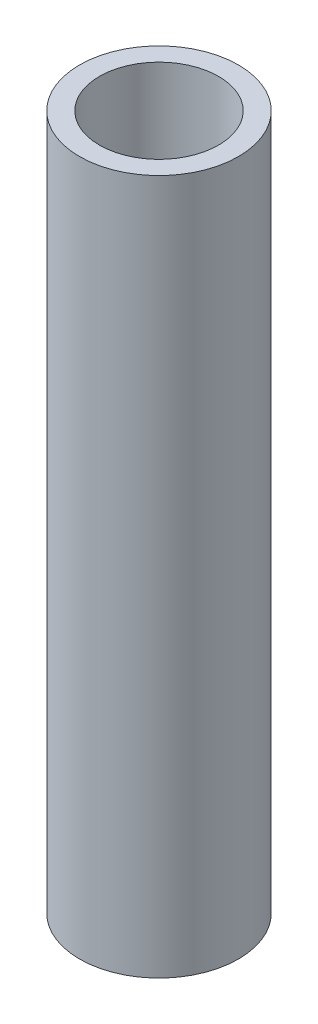
ISO-10303-21;
HEADER;
FILE_DESCRIPTION(('STEP AP214'),'2;1');
FILE_NAME('part.step','',(''),(''),'','','');
FILE_SCHEMA(('AUTOMOTIVE_DESIGN { 1 0 10303 214 1 1 1 1 }'));
ENDSEC;
DATA;
#1=APPLICATION_CONTEXT('core data for automotive mechanical design processes');
#2=APPLICATION_PROTOCOL_DEFINITION('international standard','automotive_design',2000,#1);
#3=PRODUCT_CONTEXT('',#1,'mechanical');
#4=PRODUCT('Part','Part','',(#3));
#5=PRODUCT_RELATED_PRODUCT_CATEGORY('part','',(#4));
#6=PRODUCT_DEFINITION_FORMATION('','',#4);
#7=PRODUCT_DEFINITION_CONTEXT('part definition',#1,'design');
#8=PRODUCT_DEFINITION('design','',#6,#7);
#9=PRODUCT_DEFINITION_SHAPE('','',#8);
#10=(LENGTH_UNIT() NAMED_UNIT(*) SI_UNIT(.MILLI.,.METRE.));
#11=(NAMED_UNIT(*) PLANE_ANGLE_UNIT() SI_UNIT($,.RADIAN.));
#12=(NAMED_UNIT(*) SI_UNIT($,.STERADIAN.) SOLID_ANGLE_UNIT());
#13=UNCERTAINTY_MEASURE_WITH_UNIT(LENGTH_MEASURE(1.E-05),#10,'distance_accuracy_value','');
#14=(GEOMETRIC_REPRESENTATION_CONTEXT(3) GLOBAL_UNCERTAINTY_ASSIGNED_CONTEXT((#13)) GLOBAL_UNIT_ASSIGNED_CONTEXT((#10,
#11,#12)) REPRESENTATION_CONTEXT('',''));
#15=CARTESIAN_POINT('',(0.,0.,0.));
#16=DIRECTION('',(0.,0.,1.));
#17=DIRECTION('',(1.,0.,0.));
#18=AXIS2_PLACEMENT_3D('',#15,#16,#17);
#19=CARTESIAN_POINT('',(0.,-70.,0.));
#20=DIRECTION('',(0.,1.,0.));
#21=DIRECTION('',(0.,0.,1.));
#22=AXIS2_PLACEMENT_3D('',#19,#20,#21);
#23=CYLINDRICAL_SURFACE('',#22,8.);
#24=CARTESIAN_POINT('',(0.,-70.,0.));
#25=DIRECTION('',(0.,1.,0.));
#26=DIRECTION('',(1.,0.,0.));
#27=AXIS2_PLACEMENT_3D('',#24,#25,#26);
#28=CIRCLE('',#27,8.);
#29=CARTESIAN_POINT('',(8.,-70.,0.));
#30=VERTEX_POINT('',#29);
#31=EDGE_CURVE('E11',#30,#30,#28,.T.);
#32=ORIENTED_EDGE('',*,*,#31,.T.);
#33=EDGE_LOOP('',(#32));
#34=FACE_BOUND('',#33,.T.);
#35=CARTESIAN_POINT('',(0.,0.,0.));
#36=DIRECTION('',(0.,1.,0.));
#37=DIRECTION('',(1.,0.,0.));
#38=AXIS2_PLACEMENT_3D('',#35,#36,#37);
#39=CIRCLE('',#38,8.);
#40=CARTESIAN_POINT('',(8.,0.,0.));
#41=VERTEX_POINT('',#40);
#42=EDGE_CURVE('E40',#41,#41,#39,.T.);
#43=ORIENTED_EDGE('',*,*,#42,.F.);
#44=EDGE_LOOP('',(#43));
#45=FACE_BOUND('',#44,.T.);
#46=ADVANCED_FACE('F37',(#34,#45),#23,.T.);
#47=CARTESIAN_POINT('',(0.,-70.,0.));
#48=DIRECTION('',(0.,1.,0.));
#49=DIRECTION('',(0.,0.,1.));
#50=AXIS2_PLACEMENT_3D('',#47,#48,#49);
#51=PLANE('',#50);
#52=CARTESIAN_POINT('',(0.,-70.,0.));
#53=DIRECTION('',(0.,1.,0.));
#54=DIRECTION('',(0.,0.,1.));
#55=AXIS2_PLACEMENT_3D('',#52,#53,#54);
#56=CIRCLE('',#55,6.);
#57=CARTESIAN_POINT('',(0.,-70.,6.));
#58=VERTEX_POINT('',#57);
#59=EDGE_CURVE('E47',#58,#58,#56,.T.);
#60=ORIENTED_EDGE('',*,*,#59,.T.);
#61=EDGE_LOOP('',(#60));
#62=FACE_BOUND('',#61,.T.);
#63=ORIENTED_EDGE('',*,*,#31,.F.);
#64=EDGE_LOOP('',(#63));
#65=FACE_BOUND('',#64,.T.);
#66=ADVANCED_FACE('F55',(#62,#65),#51,.F.);
#67=CARTESIAN_POINT('',(0.,0.,0.));
#68=DIRECTION('',(0.,1.,0.));
#69=DIRECTION('',(0.,0.,1.));
#70=AXIS2_PLACEMENT_3D('',#67,#68,#69);
#71=PLANE('',#70);
#72=CARTESIAN_POINT('',(0.,0.,0.));
#73=DIRECTION('',(0.,1.,0.));
#74=DIRECTION('',(0.,0.,1.));
#75=AXIS2_PLACEMENT_3D('',#72,#73,#74);
#76=CIRCLE('',#75,6.);
#77=CARTESIAN_POINT('',(0.,0.,6.));
#78=VERTEX_POINT('',#77);
#79=EDGE_CURVE('E49',#78,#78,#76,.T.);
#80=ORIENTED_EDGE('',*,*,#79,.F.);
#81=EDGE_LOOP('',(#80));
#82=FACE_BOUND('',#81,.T.);
#83=ORIENTED_EDGE('',*,*,#42,.T.);
#84=EDGE_LOOP('',(#83));
#85=FACE_BOUND('',#84,.T.);
#86=ADVANCED_FACE('F61',(#82,#85),#71,.T.);
#87=CARTESIAN_POINT('',(0.,-70.,0.));
#88=DIRECTION('',(0.,1.,0.));
#89=DIRECTION('',(0.,0.,1.));
#90=AXIS2_PLACEMENT_3D('',#87,#88,#89);
#91=CYLINDRICAL_SURFACE('',#90,6.);
#92=ORIENTED_EDGE('',*,*,#59,.F.);
#93=EDGE_LOOP('',(#92));
#94=FACE_BOUND('',#93,.T.);
#95=ORIENTED_EDGE('',*,*,#79,.T.);
#96=EDGE_LOOP('',(#95));
#97=FACE_BOUND('',#96,.T.);
#98=ADVANCED_FACE('F58',(#94,#97),#91,.F.);
#99=CLOSED_SHELL('',(#46,#66,#86,#98));
#100=MANIFOLD_SOLID_BREP('B2',#99);
#101=ADVANCED_BREP_SHAPE_REPRESENTATION('',(#18,#100),#14);
#102=SHAPE_DEFINITION_REPRESENTATION(#9,#101);
ENDSEC;
END-ISO-10303-21;
